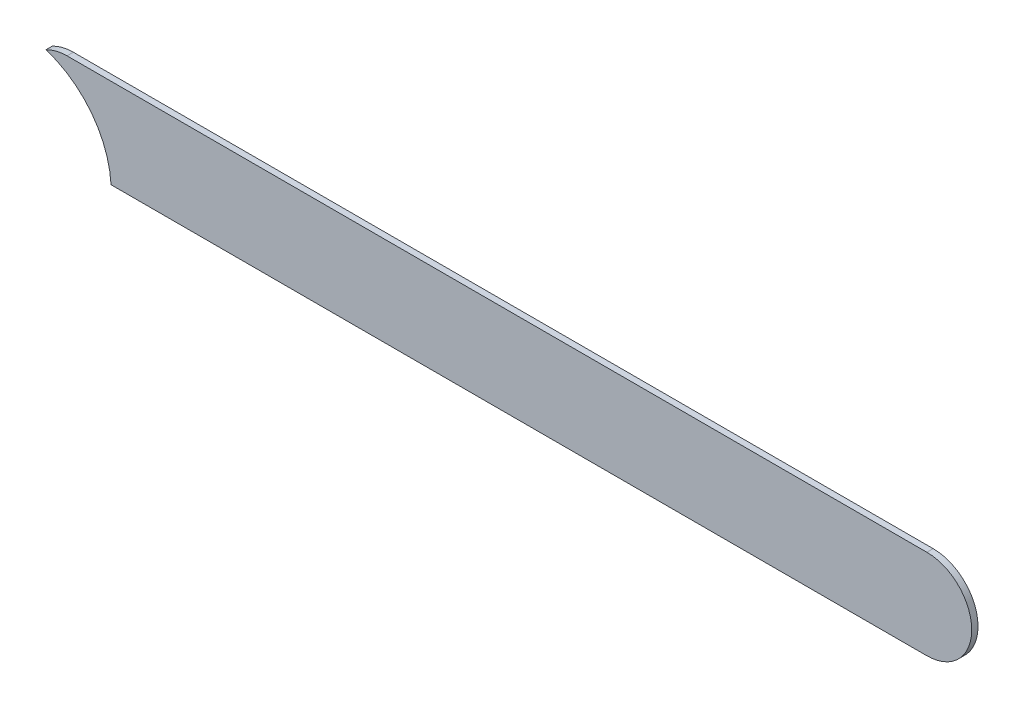
ISO-10303-21;
HEADER;
FILE_DESCRIPTION(('STEP AP214'),'2;1');
FILE_NAME('part.step','',(''),(''),'','','');
FILE_SCHEMA(('AUTOMOTIVE_DESIGN { 1 0 10303 214 1 1 1 1 }'));
ENDSEC;
DATA;
#1=APPLICATION_CONTEXT('core data for automotive mechanical design processes');
#2=APPLICATION_PROTOCOL_DEFINITION('international standard','automotive_design',2000,#1);
#3=PRODUCT_CONTEXT('',#1,'mechanical');
#4=PRODUCT('Part','Part','',(#3));
#5=PRODUCT_RELATED_PRODUCT_CATEGORY('part','',(#4));
#6=PRODUCT_DEFINITION_FORMATION('','',#4);
#7=PRODUCT_DEFINITION_CONTEXT('part definition',#1,'design');
#8=PRODUCT_DEFINITION('design','',#6,#7);
#9=PRODUCT_DEFINITION_SHAPE('','',#8);
#10=(LENGTH_UNIT() NAMED_UNIT(*) SI_UNIT(.MILLI.,.METRE.));
#11=(NAMED_UNIT(*) PLANE_ANGLE_UNIT() SI_UNIT($,.RADIAN.));
#12=(NAMED_UNIT(*) SI_UNIT($,.STERADIAN.) SOLID_ANGLE_UNIT());
#13=UNCERTAINTY_MEASURE_WITH_UNIT(LENGTH_MEASURE(1.E-05),#10,'distance_accuracy_value','');
#14=(GEOMETRIC_REPRESENTATION_CONTEXT(3) GLOBAL_UNCERTAINTY_ASSIGNED_CONTEXT((#13)) GLOBAL_UNIT_ASSIGNED_CONTEXT((#10,
#11,#12)) REPRESENTATION_CONTEXT('',''));
#15=CARTESIAN_POINT('',(0.,0.,0.));
#16=DIRECTION('',(0.,0.,1.));
#17=DIRECTION('',(1.,0.,0.));
#18=AXIS2_PLACEMENT_3D('',#15,#16,#17);
#19=CARTESIAN_POINT('',(144.526,-111.2052,-0.035));
#20=DIRECTION('',(0.,-1.,0.));
#21=DIRECTION('',(0.,0.,-1.));
#22=AXIS2_PLACEMENT_3D('',#19,#20,#21);
#23=PLANE('',#22);
#24=DIRECTION('',(-1.,0.,0.));
#25=VECTOR('',#24,1.);
#26=CARTESIAN_POINT('',(144.526,-111.2052,-0.035));
#27=LINE('',#26,#25);
#28=CARTESIAN_POINT('',(144.526,-111.2052,-0.035));
#29=VERTEX_POINT('',#28);
#30=CARTESIAN_POINT('',(139.7308,-111.2052,-0.035));
#31=VERTEX_POINT('',#30);
#32=EDGE_CURVE('E121',#29,#31,#27,.T.);
#33=ORIENTED_EDGE('',*,*,#32,.T.);
#34=DIRECTION('',(0.,0.,1.));
#35=VECTOR('',#34,1.);
#36=CARTESIAN_POINT('',(139.7308,-111.2052,-0.035));
#37=LINE('',#36,#35);
#38=CARTESIAN_POINT('',(139.7308,-111.2052,0.));
#39=VERTEX_POINT('',#38);
#40=EDGE_CURVE('E11',#31,#39,#37,.T.);
#41=ORIENTED_EDGE('',*,*,#40,.T.);
#42=DIRECTION('',(-1.,0.,0.));
#43=VECTOR('',#42,1.);
#44=CARTESIAN_POINT('',(144.526,-111.2052,0.));
#45=LINE('',#44,#43);
#46=CARTESIAN_POINT('',(144.526,-111.2052,0.));
#47=VERTEX_POINT('',#46);
#48=EDGE_CURVE('E90',#47,#39,#45,.T.);
#49=ORIENTED_EDGE('',*,*,#48,.F.);
#50=DIRECTION('',(0.,0.,1.));
#51=VECTOR('',#50,1.);
#52=CARTESIAN_POINT('',(144.526,-111.2052,-0.035));
#53=LINE('',#52,#51);
#54=EDGE_CURVE('E126',#29,#47,#53,.T.);
#55=ORIENTED_EDGE('',*,*,#54,.F.);
#56=EDGE_LOOP('',(#33,#41,#49,#55));
#57=FACE_BOUND('',#56,.T.);
#58=ADVANCED_FACE('F17',(#57),#23,.F.);
#59=CARTESIAN_POINT('',(139.7308,-111.4552,-0.035));
#60=DIRECTION('',(0.,0.,-1.));
#61=DIRECTION('',(0.,1.,0.));
#62=AXIS2_PLACEMENT_3D('',#59,#60,#61);
#63=CYLINDRICAL_SURFACE('',#62,0.25);
#64=DIRECTION('',(0.,0.,-1.));
#65=VECTOR('',#64,1.);
#66=CARTESIAN_POINT('',(139.61346438152,-111.2344459453,-0.035));
#67=LINE('',#66,#65);
#68=CARTESIAN_POINT('',(139.61346438151,-111.2344459453,0.));
#69=VERTEX_POINT('',#68);
#70=CARTESIAN_POINT('',(139.61346438151,-111.2344459453,-0.035));
#71=VERTEX_POINT('',#70);
#72=EDGE_CURVE('E26',#69,#71,#67,.T.);
#73=ORIENTED_EDGE('',*,*,#72,.F.);
#74=CARTESIAN_POINT('',(139.7308,-111.4552,0.));
#75=DIRECTION('',(0.,0.,1.));
#76=DIRECTION('',(0.,1.,0.));
#77=AXIS2_PLACEMENT_3D('',#74,#75,#76);
#78=CIRCLE('',#77,0.25);
#79=EDGE_CURVE('E87',#39,#69,#78,.T.);
#80=ORIENTED_EDGE('',*,*,#79,.F.);
#81=ORIENTED_EDGE('',*,*,#40,.F.);
#82=CARTESIAN_POINT('',(139.7308,-111.4552,-0.035));
#83=DIRECTION('',(0.,0.,1.));
#84=DIRECTION('',(0.,1.,0.));
#85=AXIS2_PLACEMENT_3D('',#82,#83,#84);
#86=CIRCLE('',#85,0.25);
#87=EDGE_CURVE('E118',#31,#71,#86,.T.);
#88=ORIENTED_EDGE('',*,*,#87,.T.);
#89=EDGE_LOOP('',(#73,#80,#81,#88));
#90=FACE_BOUND('',#89,.T.);
#91=ADVANCED_FACE('F142',(#90),#63,.T.);
#92=CARTESIAN_POINT('',(139.452,-111.734,-0.045));
#93=DIRECTION('',(0.,0.,-1.));
#94=DIRECTION('',(0.,-1.,0.));
#95=AXIS2_PLACEMENT_3D('',#92,#93,#94);
#96=CYLINDRICAL_SURFACE('',#95,0.525);
#97=DIRECTION('',(0.,0.,-1.));
#98=VECTOR('',#97,1.);
#99=CARTESIAN_POINT('',(139.97620946195,-111.7052,-0.045));
#100=LINE('',#99,#98);
#101=CARTESIAN_POINT('',(139.97620946195,-111.7052,0.));
#102=VERTEX_POINT('',#101);
#103=CARTESIAN_POINT('',(139.97620946195,-111.7052,-0.035));
#104=VERTEX_POINT('',#103);
#105=EDGE_CURVE('E93',#102,#104,#100,.T.);
#106=ORIENTED_EDGE('',*,*,#105,.F.);
#107=CARTESIAN_POINT('',(139.452,-111.734,0.));
#108=DIRECTION('',(0.,0.,-1.));
#109=DIRECTION('',(0.,-1.,0.));
#110=AXIS2_PLACEMENT_3D('',#107,#108,#109);
#111=CIRCLE('',#110,0.525);
#112=EDGE_CURVE('E79',#69,#102,#111,.T.);
#113=ORIENTED_EDGE('',*,*,#112,.F.);
#114=ORIENTED_EDGE('',*,*,#72,.T.);
#115=CARTESIAN_POINT('',(139.452,-111.734,-0.035));
#116=DIRECTION('',(0.,0.,-1.));
#117=DIRECTION('',(0.,-1.,0.));
#118=AXIS2_PLACEMENT_3D('',#115,#116,#117);
#119=CIRCLE('',#118,0.525);
#120=EDGE_CURVE('E96',#71,#104,#119,.T.);
#121=ORIENTED_EDGE('',*,*,#120,.T.);
#122=EDGE_LOOP('',(#106,#113,#114,#121));
#123=FACE_BOUND('',#122,.T.);
#124=ADVANCED_FACE('F94',(#123),#96,.F.);
#125=CARTESIAN_POINT('',(139.7308,-111.7052,0.));
#126=DIRECTION('',(0.,0.,1.));
#127=DIRECTION('',(1.,0.,0.));
#128=AXIS2_PLACEMENT_3D('',#125,#126,#127);
#129=PLANE('',#128);
#130=ORIENTED_EDGE('',*,*,#112,.T.);
#131=DIRECTION('',(1.,0.,0.));
#132=VECTOR('',#131,1.);
#133=CARTESIAN_POINT('',(139.7308,-111.7052,0.));
#134=LINE('',#133,#132);
#135=CARTESIAN_POINT('',(144.526,-111.7052,0.));
#136=VERTEX_POINT('',#135);
#137=EDGE_CURVE('E84',#102,#136,#134,.T.);
#138=ORIENTED_EDGE('',*,*,#137,.T.);
#139=CARTESIAN_POINT('',(144.526,-111.4552,0.));
#140=DIRECTION('',(0.,0.,1.));
#141=DIRECTION('',(0.,-1.,0.));
#142=AXIS2_PLACEMENT_3D('',#139,#140,#141);
#143=CIRCLE('',#142,0.25);
#144=EDGE_CURVE('E20',#136,#47,#143,.T.);
#145=ORIENTED_EDGE('',*,*,#144,.T.);
#146=ORIENTED_EDGE('',*,*,#48,.T.);
#147=ORIENTED_EDGE('',*,*,#79,.T.);
#148=EDGE_LOOP('',(#130,#138,#145,#146,#147));
#149=FACE_BOUND('',#148,.T.);
#150=ADVANCED_FACE('F81',(#149),#129,.T.);
#151=CARTESIAN_POINT('',(144.526,-111.4552,-0.035));
#152=DIRECTION('',(0.,0.,-1.));
#153=DIRECTION('',(0.,-1.,0.));
#154=AXIS2_PLACEMENT_3D('',#151,#152,#153);
#155=CYLINDRICAL_SURFACE('',#154,0.25);
#156=CARTESIAN_POINT('',(144.526,-111.4552,-0.035));
#157=DIRECTION('',(0.,0.,1.));
#158=DIRECTION('',(0.,-1.,0.));
#159=AXIS2_PLACEMENT_3D('',#156,#157,#158);
#160=CIRCLE('',#159,0.25);
#161=CARTESIAN_POINT('',(144.526,-111.7052,-0.035));
#162=VERTEX_POINT('',#161);
#163=EDGE_CURVE('E114',#162,#29,#160,.T.);
#164=ORIENTED_EDGE('',*,*,#163,.T.);
#165=ORIENTED_EDGE('',*,*,#54,.T.);
#166=ORIENTED_EDGE('',*,*,#144,.F.);
#167=DIRECTION('',(0.,0.,1.));
#168=VECTOR('',#167,1.);
#169=CARTESIAN_POINT('',(144.526,-111.7052,-0.035));
#170=LINE('',#169,#168);
#171=EDGE_CURVE('E105',#162,#136,#170,.T.);
#172=ORIENTED_EDGE('',*,*,#171,.F.);
#173=EDGE_LOOP('',(#164,#165,#166,#172));
#174=FACE_BOUND('',#173,.T.);
#175=ADVANCED_FACE('F138',(#174),#155,.T.);
#176=CARTESIAN_POINT('',(139.7308,-111.7052,-0.035));
#177=DIRECTION('',(0.,0.,1.));
#178=DIRECTION('',(1.,0.,0.));
#179=AXIS2_PLACEMENT_3D('',#176,#177,#178);
#180=PLANE('',#179);
#181=ORIENTED_EDGE('',*,*,#87,.F.);
#182=ORIENTED_EDGE('',*,*,#32,.F.);
#183=ORIENTED_EDGE('',*,*,#163,.F.);
#184=DIRECTION('',(1.,0.,0.));
#185=VECTOR('',#184,1.);
#186=CARTESIAN_POINT('',(139.7308,-111.7052,-0.035));
#187=LINE('',#186,#185);
#188=EDGE_CURVE('E101',#104,#162,#187,.T.);
#189=ORIENTED_EDGE('',*,*,#188,.F.);
#190=ORIENTED_EDGE('',*,*,#120,.F.);
#191=EDGE_LOOP('',(#181,#182,#183,#189,#190));
#192=FACE_BOUND('',#191,.T.);
#193=ADVANCED_FACE('F141',(#192),#180,.F.);
#194=CARTESIAN_POINT('',(139.7308,-111.7052,-0.035));
#195=DIRECTION('',(0.,1.,0.));
#196=DIRECTION('',(1.,0.,0.));
#197=AXIS2_PLACEMENT_3D('',#194,#195,#196);
#198=PLANE('',#197);
#199=ORIENTED_EDGE('',*,*,#171,.T.);
#200=ORIENTED_EDGE('',*,*,#137,.F.);
#201=ORIENTED_EDGE('',*,*,#105,.T.);
#202=ORIENTED_EDGE('',*,*,#188,.T.);
#203=EDGE_LOOP('',(#199,#200,#201,#202));
#204=FACE_BOUND('',#203,.T.);
#205=ADVANCED_FACE('F103',(#204),#198,.F.);
#206=CLOSED_SHELL('',(#58,#91,#124,#150,#175,#193,#205));
#207=MANIFOLD_SOLID_BREP('B1',#206);
#208=ADVANCED_BREP_SHAPE_REPRESENTATION('',(#18,#207),#14);
#209=SHAPE_DEFINITION_REPRESENTATION(#9,#208);
ENDSEC;
END-ISO-10303-21;
